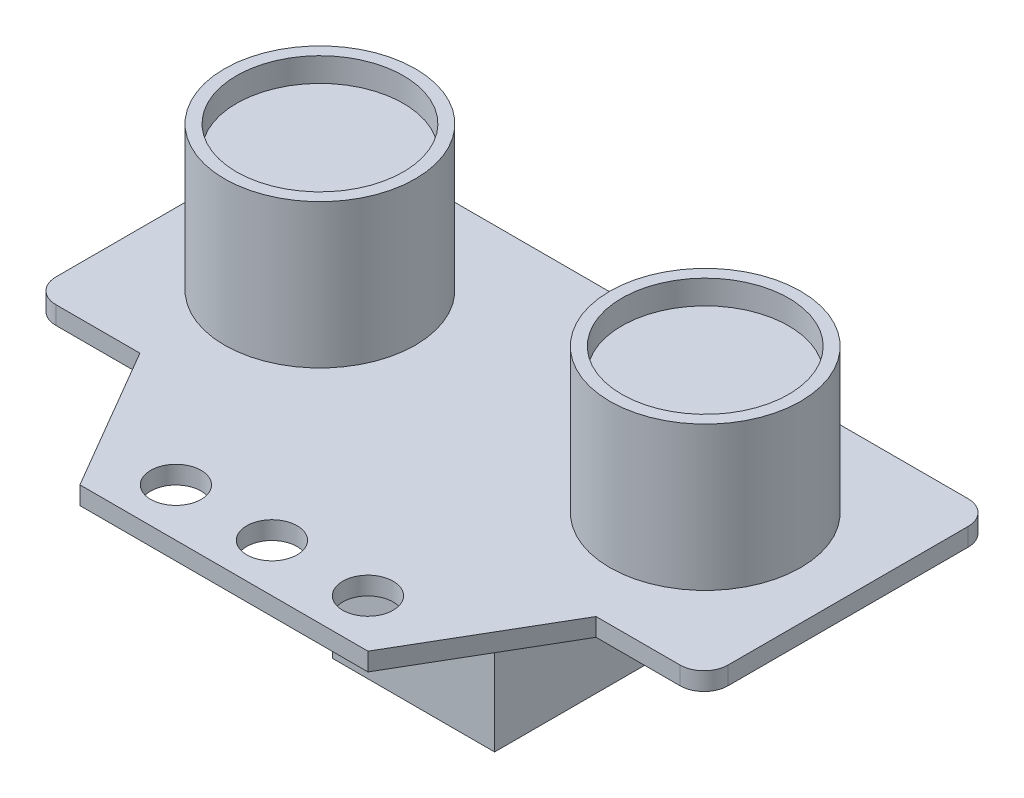
ISO-10303-21;
HEADER;
FILE_DESCRIPTION(('STEP AP214'),'2;1');
FILE_NAME('part.step','',(''),(''),'','','');
FILE_SCHEMA(('AUTOMOTIVE_DESIGN { 1 0 10303 214 1 1 1 1 }'));
ENDSEC;
DATA;
#1=APPLICATION_CONTEXT('core data for automotive mechanical design processes');
#2=APPLICATION_PROTOCOL_DEFINITION('international standard','automotive_design',2000,#1);
#3=PRODUCT_CONTEXT('',#1,'mechanical');
#4=PRODUCT('Part','Part','',(#3));
#5=PRODUCT_RELATED_PRODUCT_CATEGORY('part','',(#4));
#6=PRODUCT_DEFINITION_FORMATION('','',#4);
#7=PRODUCT_DEFINITION_CONTEXT('part definition',#1,'design');
#8=PRODUCT_DEFINITION('design','',#6,#7);
#9=PRODUCT_DEFINITION_SHAPE('','',#8);
#10=(LENGTH_UNIT() NAMED_UNIT(*) SI_UNIT(.MILLI.,.METRE.));
#11=(NAMED_UNIT(*) PLANE_ANGLE_UNIT() SI_UNIT($,.RADIAN.));
#12=(NAMED_UNIT(*) SI_UNIT($,.STERADIAN.) SOLID_ANGLE_UNIT());
#13=UNCERTAINTY_MEASURE_WITH_UNIT(LENGTH_MEASURE(1.E-05),#10,'distance_accuracy_value','');
#14=(GEOMETRIC_REPRESENTATION_CONTEXT(3) GLOBAL_UNCERTAINTY_ASSIGNED_CONTEXT((#13)) GLOBAL_UNIT_ASSIGNED_CONTEXT((#10,
#11,#12)) REPRESENTATION_CONTEXT('',''));
#15=CARTESIAN_POINT('',(0.,0.,0.));
#16=DIRECTION('',(0.,0.,1.));
#17=DIRECTION('',(1.,0.,0.));
#18=AXIS2_PLACEMENT_3D('',#15,#16,#17);
#19=CARTESIAN_POINT('',(0.,0.,0.));
#20=DIRECTION('',(0.,-1.,0.));
#21=DIRECTION('',(0.,0.,-1.));
#22=AXIS2_PLACEMENT_3D('',#19,#20,#21);
#23=PLANE('',#22);
#24=CARTESIAN_POINT('',(-8.,0.,-4.));
#25=DIRECTION('',(0.,1.,0.));
#26=DIRECTION('',(0.,0.,1.));
#27=AXIS2_PLACEMENT_3D('',#24,#25,#26);
#28=CIRCLE('',#27,2.1);
#29=CARTESIAN_POINT('',(-8.,0.,-1.9));
#30=VERTEX_POINT('',#29);
#31=EDGE_CURVE('E185',#30,#30,#28,.T.);
#32=ORIENTED_EDGE('',*,*,#31,.T.);
#33=EDGE_LOOP('',(#32));
#34=FACE_BOUND('',#33,.T.);
#35=DIRECTION('',(0.,0.,-1.));
#36=VECTOR('',#35,1.);
#37=CARTESIAN_POINT('',(28.,0.,-12.));
#38=LINE('',#37,#36);
#39=CARTESIAN_POINT('',(28.,0.,-14.));
#40=VERTEX_POINT('',#39);
#41=CARTESIAN_POINT('',(28.,0.,-34.));
#42=VERTEX_POINT('',#41);
#43=EDGE_CURVE('E231',#40,#42,#38,.T.);
#44=ORIENTED_EDGE('',*,*,#43,.F.);
#45=CARTESIAN_POINT('',(26.,0.,-14.));
#46=DIRECTION('',(0.,-1.,0.));
#47=DIRECTION('',(0.,0.,-1.));
#48=AXIS2_PLACEMENT_3D('',#45,#46,#47);
#49=CIRCLE('',#48,2.);
#50=CARTESIAN_POINT('',(26.,0.,-12.));
#51=VERTEX_POINT('',#50);
#52=EDGE_CURVE('E263',#40,#51,#49,.T.);
#53=ORIENTED_EDGE('',*,*,#52,.T.);
#54=DIRECTION('',(1.,0.,0.));
#55=VECTOR('',#54,1.);
#56=CARTESIAN_POINT('',(19.,0.,-12.));
#57=LINE('',#56,#55);
#58=CARTESIAN_POINT('',(19.,0.,-12.));
#59=VERTEX_POINT('',#58);
#60=EDGE_CURVE('E228',#59,#51,#57,.T.);
#61=ORIENTED_EDGE('',*,*,#60,.F.);
#62=DIRECTION('',(0.503871025524086,0.,-0.863778900898433));
#63=VECTOR('',#62,1.);
#64=CARTESIAN_POINT('',(12.,0.,0.));
#65=LINE('',#64,#63);
#66=CARTESIAN_POINT('',(12.,0.,0.));
#67=VERTEX_POINT('',#66);
#68=EDGE_CURVE('E226',#67,#59,#65,.T.);
#69=ORIENTED_EDGE('',*,*,#68,.F.);
#70=DIRECTION('',(1.,0.,0.));
#71=VECTOR('',#70,1.);
#72=CARTESIAN_POINT('',(12.,0.,0.));
#73=LINE('',#72,#71);
#74=CARTESIAN_POINT('',(-12.,0.,0.));
#75=VERTEX_POINT('',#74);
#76=EDGE_CURVE('E224',#75,#67,#73,.T.);
#77=ORIENTED_EDGE('',*,*,#76,.F.);
#78=DIRECTION('',(0.503871025524086,0.,0.863778900898433));
#79=VECTOR('',#78,1.);
#80=CARTESIAN_POINT('',(-12.,0.,0.));
#81=LINE('',#80,#79);
#82=CARTESIAN_POINT('',(-19.,0.,-12.));
#83=VERTEX_POINT('',#82);
#84=EDGE_CURVE('E197',#83,#75,#81,.T.);
#85=ORIENTED_EDGE('',*,*,#84,.F.);
#86=DIRECTION('',(1.,0.,0.));
#87=VECTOR('',#86,1.);
#88=CARTESIAN_POINT('',(-19.,0.,-12.));
#89=LINE('',#88,#87);
#90=CARTESIAN_POINT('',(-26.,0.,-12.));
#91=VERTEX_POINT('',#90);
#92=EDGE_CURVE('E204',#91,#83,#89,.T.);
#93=ORIENTED_EDGE('',*,*,#92,.F.);
#94=CARTESIAN_POINT('',(-26.,0.,-14.));
#95=DIRECTION('',(0.,-1.,0.));
#96=DIRECTION('',(0.,0.,-1.));
#97=AXIS2_PLACEMENT_3D('',#94,#95,#96);
#98=CIRCLE('',#97,2.);
#99=CARTESIAN_POINT('',(-28.,0.,-14.));
#100=VERTEX_POINT('',#99);
#101=EDGE_CURVE('E257',#91,#100,#98,.T.);
#102=ORIENTED_EDGE('',*,*,#101,.T.);
#103=DIRECTION('',(0.,0.,1.));
#104=VECTOR('',#103,1.);
#105=CARTESIAN_POINT('',(-28.,0.,-12.));
#106=LINE('',#105,#104);
#107=CARTESIAN_POINT('',(-28.,0.,-34.));
#108=VERTEX_POINT('',#107);
#109=EDGE_CURVE('E237',#108,#100,#106,.T.);
#110=ORIENTED_EDGE('',*,*,#109,.F.);
#111=CARTESIAN_POINT('',(-26.,0.,-34.));
#112=DIRECTION('',(0.,-1.,0.));
#113=DIRECTION('',(0.,0.,-1.));
#114=AXIS2_PLACEMENT_3D('',#111,#112,#113);
#115=CIRCLE('',#114,2.);
#116=CARTESIAN_POINT('',(-26.,0.,-36.));
#117=VERTEX_POINT('',#116);
#118=EDGE_CURVE('E259',#108,#117,#115,.T.);
#119=ORIENTED_EDGE('',*,*,#118,.T.);
#120=DIRECTION('',(-1.,0.,0.));
#121=VECTOR('',#120,1.);
#122=CARTESIAN_POINT('',(-28.,0.,-36.));
#123=LINE('',#122,#121);
#124=CARTESIAN_POINT('',(26.,0.,-36.));
#125=VERTEX_POINT('',#124);
#126=EDGE_CURVE('E234',#125,#117,#123,.T.);
#127=ORIENTED_EDGE('',*,*,#126,.F.);
#128=CARTESIAN_POINT('',(26.,0.,-34.));
#129=DIRECTION('',(0.,-1.,0.));
#130=DIRECTION('',(0.,0.,-1.));
#131=AXIS2_PLACEMENT_3D('',#128,#129,#130);
#132=CIRCLE('',#131,2.);
#133=EDGE_CURVE('E261',#125,#42,#132,.T.);
#134=ORIENTED_EDGE('',*,*,#133,.T.);
#135=EDGE_LOOP('',(#44,#53,#61,#69,#77,#85,#93,#102,#110,#119,#127,#134));
#136=FACE_BOUND('',#135,.T.);
#137=CARTESIAN_POINT('',(0.,0.,-4.));
#138=DIRECTION('',(0.,1.,0.));
#139=DIRECTION('',(0.,0.,1.));
#140=AXIS2_PLACEMENT_3D('',#137,#138,#139);
#141=CIRCLE('',#140,2.1);
#142=CARTESIAN_POINT('',(0.,0.,-1.9));
#143=VERTEX_POINT('',#142);
#144=EDGE_CURVE('E191',#143,#143,#141,.T.);
#145=ORIENTED_EDGE('',*,*,#144,.T.);
#146=EDGE_LOOP('',(#145));
#147=FACE_BOUND('',#146,.T.);
#148=CARTESIAN_POINT('',(8.,0.,-4.));
#149=DIRECTION('',(0.,1.,0.));
#150=DIRECTION('',(0.,0.,1.));
#151=AXIS2_PLACEMENT_3D('',#148,#149,#150);
#152=CIRCLE('',#151,2.1);
#153=CARTESIAN_POINT('',(8.,0.,-1.9));
#154=VERTEX_POINT('',#153);
#155=EDGE_CURVE('E181',#154,#154,#152,.T.);
#156=ORIENTED_EDGE('',*,*,#155,.T.);
#157=EDGE_LOOP('',(#156));
#158=FACE_BOUND('',#157,.T.);
#159=DIRECTION('',(1.,0.,0.));
#160=VECTOR('',#159,1.);
#161=CARTESIAN_POINT('',(-6.75,0.,-31.8));
#162=LINE('',#161,#160);
#163=CARTESIAN_POINT('',(-6.75,0.,-31.8));
#164=VERTEX_POINT('',#163);
#165=CARTESIAN_POINT('',(6.75,0.,-31.8));
#166=VERTEX_POINT('',#165);
#167=EDGE_CURVE('E318',#164,#166,#162,.T.);
#168=ORIENTED_EDGE('',*,*,#167,.F.);
#169=DIRECTION('',(0.,0.,-1.));
#170=VECTOR('',#169,1.);
#171=CARTESIAN_POINT('',(-6.75,0.,-15.8));
#172=LINE('',#171,#170);
#173=CARTESIAN_POINT('',(-6.75,0.,-15.8));
#174=VERTEX_POINT('',#173);
#175=EDGE_CURVE('E169',#174,#164,#172,.T.);
#176=ORIENTED_EDGE('',*,*,#175,.F.);
#177=DIRECTION('',(-1.,0.,0.));
#178=VECTOR('',#177,1.);
#179=CARTESIAN_POINT('',(-6.75,0.,-15.8));
#180=LINE('',#179,#178);
#181=CARTESIAN_POINT('',(6.75,0.,-15.8));
#182=VERTEX_POINT('',#181);
#183=EDGE_CURVE('E165',#182,#174,#180,.T.);
#184=ORIENTED_EDGE('',*,*,#183,.F.);
#185=DIRECTION('',(0.,0.,1.));
#186=VECTOR('',#185,1.);
#187=CARTESIAN_POINT('',(6.75,0.,-15.8));
#188=LINE('',#187,#186);
#189=EDGE_CURVE('E320',#166,#182,#188,.T.);
#190=ORIENTED_EDGE('',*,*,#189,.F.);
#191=EDGE_LOOP('',(#168,#176,#184,#190));
#192=FACE_BOUND('',#191,.T.);
#193=ADVANCED_FACE('F32',(#34,#136,#147,#158,#192),#23,.T.);
#194=CARTESIAN_POINT('',(0.,1.5,0.));
#195=DIRECTION('',(0.,-1.,0.));
#196=DIRECTION('',(0.,0.,-1.));
#197=AXIS2_PLACEMENT_3D('',#194,#195,#196);
#198=PLANE('',#197);
#199=CARTESIAN_POINT('',(16.05,1.5,-24.05));
#200=DIRECTION('',(0.,-1.,0.));
#201=DIRECTION('',(0.,0.,-1.));
#202=AXIS2_PLACEMENT_3D('',#199,#200,#201);
#203=CIRCLE('',#202,7.95);
#204=CARTESIAN_POINT('',(16.05,1.5,-32.));
#205=VERTEX_POINT('',#204);
#206=EDGE_CURVE('E11',#205,#205,#203,.F.);
#207=ORIENTED_EDGE('',*,*,#206,.F.);
#208=EDGE_LOOP('',(#207));
#209=FACE_BOUND('',#208,.T.);
#210=CARTESIAN_POINT('',(-16.05,1.5,-24.05));
#211=DIRECTION('',(0.,-1.,0.));
#212=DIRECTION('',(0.,0.,-1.));
#213=AXIS2_PLACEMENT_3D('',#210,#211,#212);
#214=CIRCLE('',#213,7.95);
#215=CARTESIAN_POINT('',(-16.05,1.5,-32.));
#216=VERTEX_POINT('',#215);
#217=EDGE_CURVE('E40',#216,#216,#214,.F.);
#218=ORIENTED_EDGE('',*,*,#217,.F.);
#219=EDGE_LOOP('',(#218));
#220=FACE_BOUND('',#219,.T.);
#221=DIRECTION('',(1.,0.,0.));
#222=VECTOR('',#221,1.);
#223=CARTESIAN_POINT('',(19.,1.5,-12.));
#224=LINE('',#223,#222);
#225=CARTESIAN_POINT('',(19.,1.5,-12.));
#226=VERTEX_POINT('',#225);
#227=CARTESIAN_POINT('',(26.,1.5,-12.));
#228=VERTEX_POINT('',#227);
#229=EDGE_CURVE('E208',#226,#228,#224,.T.);
#230=ORIENTED_EDGE('',*,*,#229,.T.);
#231=CARTESIAN_POINT('',(26.,1.5,-14.));
#232=DIRECTION('',(0.,-1.,0.));
#233=DIRECTION('',(0.,0.,-1.));
#234=AXIS2_PLACEMENT_3D('',#231,#232,#233);
#235=CIRCLE('',#234,2.);
#236=CARTESIAN_POINT('',(28.,1.5,-14.));
#237=VERTEX_POINT('',#236);
#238=EDGE_CURVE('E272',#228,#237,#235,.F.);
#239=ORIENTED_EDGE('',*,*,#238,.T.);
#240=DIRECTION('',(0.,0.,-1.));
#241=VECTOR('',#240,1.);
#242=CARTESIAN_POINT('',(28.,1.5,-12.));
#243=LINE('',#242,#241);
#244=CARTESIAN_POINT('',(28.,1.5,-34.));
#245=VERTEX_POINT('',#244);
#246=EDGE_CURVE('E211',#237,#245,#243,.T.);
#247=ORIENTED_EDGE('',*,*,#246,.T.);
#248=CARTESIAN_POINT('',(26.,1.5,-34.));
#249=DIRECTION('',(0.,-1.,0.));
#250=DIRECTION('',(0.,0.,-1.));
#251=AXIS2_PLACEMENT_3D('',#248,#249,#250);
#252=CIRCLE('',#251,2.);
#253=CARTESIAN_POINT('',(26.,1.5,-36.));
#254=VERTEX_POINT('',#253);
#255=EDGE_CURVE('E270',#245,#254,#252,.F.);
#256=ORIENTED_EDGE('',*,*,#255,.T.);
#257=DIRECTION('',(-1.,0.,0.));
#258=VECTOR('',#257,1.);
#259=CARTESIAN_POINT('',(-28.,1.5,-36.));
#260=LINE('',#259,#258);
#261=CARTESIAN_POINT('',(-26.,1.5,-36.));
#262=VERTEX_POINT('',#261);
#263=EDGE_CURVE('E214',#254,#262,#260,.T.);
#264=ORIENTED_EDGE('',*,*,#263,.T.);
#265=CARTESIAN_POINT('',(-26.,1.5,-34.));
#266=DIRECTION('',(0.,-1.,0.));
#267=DIRECTION('',(0.,0.,-1.));
#268=AXIS2_PLACEMENT_3D('',#265,#266,#267);
#269=CIRCLE('',#268,2.);
#270=CARTESIAN_POINT('',(-28.,1.5,-34.));
#271=VERTEX_POINT('',#270);
#272=EDGE_CURVE('E268',#262,#271,#269,.F.);
#273=ORIENTED_EDGE('',*,*,#272,.T.);
#274=DIRECTION('',(0.,0.,1.));
#275=VECTOR('',#274,1.);
#276=CARTESIAN_POINT('',(-28.,1.5,-12.));
#277=LINE('',#276,#275);
#278=CARTESIAN_POINT('',(-28.,1.5,-14.));
#279=VERTEX_POINT('',#278);
#280=EDGE_CURVE('E217',#271,#279,#277,.T.);
#281=ORIENTED_EDGE('',*,*,#280,.T.);
#282=CARTESIAN_POINT('',(-26.,1.5,-14.));
#283=DIRECTION('',(0.,-1.,0.));
#284=DIRECTION('',(0.,0.,-1.));
#285=AXIS2_PLACEMENT_3D('',#282,#283,#284);
#286=CIRCLE('',#285,2.);
#287=CARTESIAN_POINT('',(-26.,1.5,-12.));
#288=VERTEX_POINT('',#287);
#289=EDGE_CURVE('E55',#279,#288,#286,.F.);
#290=ORIENTED_EDGE('',*,*,#289,.T.);
#291=DIRECTION('',(1.,0.,0.));
#292=VECTOR('',#291,1.);
#293=CARTESIAN_POINT('',(-19.,1.5,-12.));
#294=LINE('',#293,#292);
#295=CARTESIAN_POINT('',(-19.,1.5,-12.));
#296=VERTEX_POINT('',#295);
#297=EDGE_CURVE('E219',#288,#296,#294,.T.);
#298=ORIENTED_EDGE('',*,*,#297,.T.);
#299=DIRECTION('',(0.503871025524086,0.,0.863778900898433));
#300=VECTOR('',#299,1.);
#301=CARTESIAN_POINT('',(-12.,1.5,0.));
#302=LINE('',#301,#300);
#303=CARTESIAN_POINT('',(-12.,1.5,0.));
#304=VERTEX_POINT('',#303);
#305=EDGE_CURVE('E200',#296,#304,#302,.T.);
#306=ORIENTED_EDGE('',*,*,#305,.T.);
#307=DIRECTION('',(1.,0.,0.));
#308=VECTOR('',#307,1.);
#309=CARTESIAN_POINT('',(12.,1.5,0.));
#310=LINE('',#309,#308);
#311=CARTESIAN_POINT('',(12.,1.5,0.));
#312=VERTEX_POINT('',#311);
#313=EDGE_CURVE('E203',#304,#312,#310,.T.);
#314=ORIENTED_EDGE('',*,*,#313,.T.);
#315=DIRECTION('',(0.503871025524086,0.,-0.863778900898433));
#316=VECTOR('',#315,1.);
#317=CARTESIAN_POINT('',(12.,1.5,0.));
#318=LINE('',#317,#316);
#319=EDGE_CURVE('E206',#312,#226,#318,.T.);
#320=ORIENTED_EDGE('',*,*,#319,.T.);
#321=EDGE_LOOP('',(#230,#239,#247,#256,#264,#273,#281,#290,#298,#306,#314,#320));
#322=FACE_BOUND('',#321,.T.);
#323=CARTESIAN_POINT('',(0.,1.5,-4.));
#324=DIRECTION('',(0.,1.,0.));
#325=DIRECTION('',(0.,0.,1.));
#326=AXIS2_PLACEMENT_3D('',#323,#324,#325);
#327=CIRCLE('',#326,2.1);
#328=CARTESIAN_POINT('',(0.,1.5,-1.9));
#329=VERTEX_POINT('',#328);
#330=EDGE_CURVE('E194',#329,#329,#327,.T.);
#331=ORIENTED_EDGE('',*,*,#330,.F.);
#332=EDGE_LOOP('',(#331));
#333=FACE_BOUND('',#332,.T.);
#334=CARTESIAN_POINT('',(-8.,1.5,-4.));
#335=DIRECTION('',(0.,1.,0.));
#336=DIRECTION('',(0.,0.,1.));
#337=AXIS2_PLACEMENT_3D('',#334,#335,#336);
#338=CIRCLE('',#337,2.1);
#339=CARTESIAN_POINT('',(-8.,1.5,-1.9));
#340=VERTEX_POINT('',#339);
#341=EDGE_CURVE('E188',#340,#340,#338,.T.);
#342=ORIENTED_EDGE('',*,*,#341,.F.);
#343=EDGE_LOOP('',(#342));
#344=FACE_BOUND('',#343,.T.);
#345=CARTESIAN_POINT('',(8.,1.5,-4.));
#346=DIRECTION('',(0.,1.,0.));
#347=DIRECTION('',(0.,0.,1.));
#348=AXIS2_PLACEMENT_3D('',#345,#346,#347);
#349=CIRCLE('',#348,2.1);
#350=CARTESIAN_POINT('',(8.,1.5,-1.9));
#351=VERTEX_POINT('',#350);
#352=EDGE_CURVE('E182',#351,#351,#349,.T.);
#353=ORIENTED_EDGE('',*,*,#352,.F.);
#354=EDGE_LOOP('',(#353));
#355=FACE_BOUND('',#354,.T.);
#356=ADVANCED_FACE('F291',(#209,#220,#322,#333,#344,#355),#198,.F.);
#357=CARTESIAN_POINT('',(-12.,1.5,0.));
#358=DIRECTION('',(0.863778900898433,0.,-0.503871025524086));
#359=DIRECTION('',(-0.503871025524086,0.,-0.863778900898433));
#360=AXIS2_PLACEMENT_3D('',#357,#358,#359);
#361=PLANE('',#360);
#362=ORIENTED_EDGE('',*,*,#84,.T.);
#363=DIRECTION('',(0.,-1.,0.));
#364=VECTOR('',#363,1.);
#365=CARTESIAN_POINT('',(-12.,1.5,0.));
#366=LINE('',#365,#364);
#367=EDGE_CURVE('E249',#304,#75,#366,.T.);
#368=ORIENTED_EDGE('',*,*,#367,.F.);
#369=ORIENTED_EDGE('',*,*,#305,.F.);
#370=DIRECTION('',(0.,-1.,0.));
#371=VECTOR('',#370,1.);
#372=CARTESIAN_POINT('',(-19.,1.5,-12.));
#373=LINE('',#372,#371);
#374=EDGE_CURVE('E221',#296,#83,#373,.T.);
#375=ORIENTED_EDGE('',*,*,#374,.T.);
#376=EDGE_LOOP('',(#362,#368,#369,#375));
#377=FACE_BOUND('',#376,.T.);
#378=ADVANCED_FACE('F293',(#377),#361,.F.);
#379=CARTESIAN_POINT('',(12.,1.5,0.));
#380=DIRECTION('',(0.,0.,-1.));
#381=DIRECTION('',(-1.,0.,0.));
#382=AXIS2_PLACEMENT_3D('',#379,#380,#381);
#383=PLANE('',#382);
#384=ORIENTED_EDGE('',*,*,#76,.T.);
#385=DIRECTION('',(0.,-1.,0.));
#386=VECTOR('',#385,1.);
#387=CARTESIAN_POINT('',(12.,1.5,0.));
#388=LINE('',#387,#386);
#389=EDGE_CURVE('E246',#312,#67,#388,.T.);
#390=ORIENTED_EDGE('',*,*,#389,.F.);
#391=ORIENTED_EDGE('',*,*,#313,.F.);
#392=ORIENTED_EDGE('',*,*,#367,.T.);
#393=EDGE_LOOP('',(#384,#390,#391,#392));
#394=FACE_BOUND('',#393,.T.);
#395=ADVANCED_FACE('F398',(#394),#383,.F.);
#396=CARTESIAN_POINT('',(12.,1.5,0.));
#397=DIRECTION('',(-0.863778900898433,0.,-0.503871025524086));
#398=DIRECTION('',(-0.503871025524086,0.,0.863778900898433));
#399=AXIS2_PLACEMENT_3D('',#396,#397,#398);
#400=PLANE('',#399);
#401=ORIENTED_EDGE('',*,*,#68,.T.);
#402=DIRECTION('',(0.,-1.,0.));
#403=VECTOR('',#402,1.);
#404=CARTESIAN_POINT('',(19.,1.5,-12.));
#405=LINE('',#404,#403);
#406=EDGE_CURVE('E243',#226,#59,#405,.T.);
#407=ORIENTED_EDGE('',*,*,#406,.F.);
#408=ORIENTED_EDGE('',*,*,#319,.F.);
#409=ORIENTED_EDGE('',*,*,#389,.T.);
#410=EDGE_LOOP('',(#401,#407,#408,#409));
#411=FACE_BOUND('',#410,.T.);
#412=ADVANCED_FACE('F394',(#411),#400,.F.);
#413=CARTESIAN_POINT('',(19.,1.5,-12.));
#414=DIRECTION('',(0.,0.,-1.));
#415=DIRECTION('',(-1.,0.,0.));
#416=AXIS2_PLACEMENT_3D('',#413,#414,#415);
#417=PLANE('',#416);
#418=ORIENTED_EDGE('',*,*,#60,.T.);
#419=DIRECTION('',(0.,-1.,0.));
#420=VECTOR('',#419,1.);
#421=CARTESIAN_POINT('',(26.,1.5,-12.));
#422=LINE('',#421,#420);
#423=EDGE_CURVE('E265',#51,#228,#422,.F.);
#424=ORIENTED_EDGE('',*,*,#423,.T.);
#425=ORIENTED_EDGE('',*,*,#229,.F.);
#426=ORIENTED_EDGE('',*,*,#406,.T.);
#427=EDGE_LOOP('',(#418,#424,#425,#426));
#428=FACE_BOUND('',#427,.T.);
#429=ADVANCED_FACE('F390',(#428),#417,.F.);
#430=CARTESIAN_POINT('',(28.,1.5,-12.));
#431=DIRECTION('',(-1.,0.,0.));
#432=DIRECTION('',(0.,0.,1.));
#433=AXIS2_PLACEMENT_3D('',#430,#431,#432);
#434=PLANE('',#433);
#435=ORIENTED_EDGE('',*,*,#246,.F.);
#436=DIRECTION('',(0.,-1.,0.));
#437=VECTOR('',#436,1.);
#438=CARTESIAN_POINT('',(28.,1.5,-14.));
#439=LINE('',#438,#437);
#440=EDGE_CURVE('E254',#237,#40,#439,.T.);
#441=ORIENTED_EDGE('',*,*,#440,.T.);
#442=ORIENTED_EDGE('',*,*,#43,.T.);
#443=DIRECTION('',(0.,-1.,0.));
#444=VECTOR('',#443,1.);
#445=CARTESIAN_POINT('',(28.,1.5,-34.));
#446=LINE('',#445,#444);
#447=EDGE_CURVE('E252',#42,#245,#446,.F.);
#448=ORIENTED_EDGE('',*,*,#447,.T.);
#449=EDGE_LOOP('',(#435,#441,#442,#448));
#450=FACE_BOUND('',#449,.T.);
#451=ADVANCED_FACE('F386',(#450),#434,.F.);
#452=CARTESIAN_POINT('',(-28.,1.5,-36.));
#453=DIRECTION('',(0.,0.,1.));
#454=DIRECTION('',(1.,0.,0.));
#455=AXIS2_PLACEMENT_3D('',#452,#453,#454);
#456=PLANE('',#455);
#457=ORIENTED_EDGE('',*,*,#263,.F.);
#458=DIRECTION('',(0.,-1.,0.));
#459=VECTOR('',#458,1.);
#460=CARTESIAN_POINT('',(26.,1.5,-36.));
#461=LINE('',#460,#459);
#462=EDGE_CURVE('E276',#254,#125,#461,.T.);
#463=ORIENTED_EDGE('',*,*,#462,.T.);
#464=ORIENTED_EDGE('',*,*,#126,.T.);
#465=DIRECTION('',(0.,-1.,0.));
#466=VECTOR('',#465,1.);
#467=CARTESIAN_POINT('',(-26.,1.5,-36.));
#468=LINE('',#467,#466);
#469=EDGE_CURVE('E274',#117,#262,#468,.F.);
#470=ORIENTED_EDGE('',*,*,#469,.T.);
#471=EDGE_LOOP('',(#457,#463,#464,#470));
#472=FACE_BOUND('',#471,.T.);
#473=ADVANCED_FACE('F382',(#472),#456,.F.);
#474=CARTESIAN_POINT('',(-28.,1.5,-12.));
#475=DIRECTION('',(1.,0.,0.));
#476=DIRECTION('',(0.,0.,-1.));
#477=AXIS2_PLACEMENT_3D('',#474,#475,#476);
#478=PLANE('',#477);
#479=ORIENTED_EDGE('',*,*,#280,.F.);
#480=DIRECTION('',(0.,-1.,0.));
#481=VECTOR('',#480,1.);
#482=CARTESIAN_POINT('',(-28.,1.5,-34.));
#483=LINE('',#482,#481);
#484=EDGE_CURVE('E281',#271,#108,#483,.T.);
#485=ORIENTED_EDGE('',*,*,#484,.T.);
#486=ORIENTED_EDGE('',*,*,#109,.T.);
#487=DIRECTION('',(0.,-1.,0.));
#488=VECTOR('',#487,1.);
#489=CARTESIAN_POINT('',(-28.,1.5,-14.));
#490=LINE('',#489,#488);
#491=EDGE_CURVE('E279',#100,#279,#490,.F.);
#492=ORIENTED_EDGE('',*,*,#491,.T.);
#493=EDGE_LOOP('',(#479,#485,#486,#492));
#494=FACE_BOUND('',#493,.T.);
#495=ADVANCED_FACE('F378',(#494),#478,.F.);
#496=CARTESIAN_POINT('',(-19.,1.5,-12.));
#497=DIRECTION('',(0.,0.,-1.));
#498=DIRECTION('',(-1.,0.,0.));
#499=AXIS2_PLACEMENT_3D('',#496,#497,#498);
#500=PLANE('',#499);
#501=ORIENTED_EDGE('',*,*,#297,.F.);
#502=DIRECTION('',(0.,-1.,0.));
#503=VECTOR('',#502,1.);
#504=CARTESIAN_POINT('',(-26.,1.5,-12.));
#505=LINE('',#504,#503);
#506=EDGE_CURVE('E284',#288,#91,#505,.T.);
#507=ORIENTED_EDGE('',*,*,#506,.T.);
#508=ORIENTED_EDGE('',*,*,#92,.T.);
#509=ORIENTED_EDGE('',*,*,#374,.F.);
#510=EDGE_LOOP('',(#501,#507,#508,#509));
#511=FACE_BOUND('',#510,.T.);
#512=ADVANCED_FACE('F373',(#511),#500,.F.);
#513=CARTESIAN_POINT('',(0.,1.5,-4.));
#514=DIRECTION('',(0.,-1.,0.));
#515=DIRECTION('',(0.,0.,-1.));
#516=AXIS2_PLACEMENT_3D('',#513,#514,#515);
#517=CYLINDRICAL_SURFACE('',#516,2.1);
#518=ORIENTED_EDGE('',*,*,#330,.T.);
#519=EDGE_LOOP('',(#518));
#520=FACE_BOUND('',#519,.T.);
#521=ORIENTED_EDGE('',*,*,#144,.F.);
#522=EDGE_LOOP('',(#521));
#523=FACE_BOUND('',#522,.T.);
#524=ADVANCED_FACE('F370',(#520,#523),#517,.F.);
#525=CARTESIAN_POINT('',(-8.,1.5,-4.));
#526=DIRECTION('',(0.,-1.,0.));
#527=DIRECTION('',(0.,0.,-1.));
#528=AXIS2_PLACEMENT_3D('',#525,#526,#527);
#529=CYLINDRICAL_SURFACE('',#528,2.1);
#530=ORIENTED_EDGE('',*,*,#341,.T.);
#531=EDGE_LOOP('',(#530));
#532=FACE_BOUND('',#531,.T.);
#533=ORIENTED_EDGE('',*,*,#31,.F.);
#534=EDGE_LOOP('',(#533));
#535=FACE_BOUND('',#534,.T.);
#536=ADVANCED_FACE('F309',(#532,#535),#529,.F.);
#537=CARTESIAN_POINT('',(8.,1.5,-4.));
#538=DIRECTION('',(0.,-1.,0.));
#539=DIRECTION('',(0.,0.,-1.));
#540=AXIS2_PLACEMENT_3D('',#537,#538,#539);
#541=CYLINDRICAL_SURFACE('',#540,2.1);
#542=ORIENTED_EDGE('',*,*,#352,.T.);
#543=EDGE_LOOP('',(#542));
#544=FACE_BOUND('',#543,.T.);
#545=ORIENTED_EDGE('',*,*,#155,.F.);
#546=EDGE_LOOP('',(#545));
#547=FACE_BOUND('',#546,.T.);
#548=ADVANCED_FACE('F305',(#544,#547),#541,.F.);
#549=CARTESIAN_POINT('',(26.,1.5,-14.));
#550=DIRECTION('',(0.,-1.,0.));
#551=DIRECTION('',(0.,0.,-1.));
#552=AXIS2_PLACEMENT_3D('',#549,#550,#551);
#553=CYLINDRICAL_SURFACE('',#552,2.);
#554=ORIENTED_EDGE('',*,*,#238,.F.);
#555=ORIENTED_EDGE('',*,*,#423,.F.);
#556=ORIENTED_EDGE('',*,*,#52,.F.);
#557=ORIENTED_EDGE('',*,*,#440,.F.);
#558=EDGE_LOOP('',(#554,#555,#556,#557));
#559=FACE_BOUND('',#558,.T.);
#560=ADVANCED_FACE('F308',(#559),#553,.T.);
#561=CARTESIAN_POINT('',(26.,1.5,-34.));
#562=DIRECTION('',(0.,-1.,0.));
#563=DIRECTION('',(0.,0.,-1.));
#564=AXIS2_PLACEMENT_3D('',#561,#562,#563);
#565=CYLINDRICAL_SURFACE('',#564,2.);
#566=ORIENTED_EDGE('',*,*,#255,.F.);
#567=ORIENTED_EDGE('',*,*,#447,.F.);
#568=ORIENTED_EDGE('',*,*,#133,.F.);
#569=ORIENTED_EDGE('',*,*,#462,.F.);
#570=EDGE_LOOP('',(#566,#567,#568,#569));
#571=FACE_BOUND('',#570,.T.);
#572=ADVANCED_FACE('F408',(#571),#565,.T.);
#573=CARTESIAN_POINT('',(-26.,1.5,-34.));
#574=DIRECTION('',(0.,-1.,0.));
#575=DIRECTION('',(0.,0.,-1.));
#576=AXIS2_PLACEMENT_3D('',#573,#574,#575);
#577=CYLINDRICAL_SURFACE('',#576,2.);
#578=ORIENTED_EDGE('',*,*,#272,.F.);
#579=ORIENTED_EDGE('',*,*,#469,.F.);
#580=ORIENTED_EDGE('',*,*,#118,.F.);
#581=ORIENTED_EDGE('',*,*,#484,.F.);
#582=EDGE_LOOP('',(#578,#579,#580,#581));
#583=FACE_BOUND('',#582,.T.);
#584=ADVANCED_FACE('F364',(#583),#577,.T.);
#585=CARTESIAN_POINT('',(-26.,1.5,-14.));
#586=DIRECTION('',(0.,-1.,0.));
#587=DIRECTION('',(0.,0.,-1.));
#588=AXIS2_PLACEMENT_3D('',#585,#586,#587);
#589=CYLINDRICAL_SURFACE('',#588,2.);
#590=ORIENTED_EDGE('',*,*,#289,.F.);
#591=ORIENTED_EDGE('',*,*,#491,.F.);
#592=ORIENTED_EDGE('',*,*,#101,.F.);
#593=ORIENTED_EDGE('',*,*,#506,.F.);
#594=EDGE_LOOP('',(#590,#591,#592,#593));
#595=FACE_BOUND('',#594,.T.);
#596=ADVANCED_FACE('F34',(#595),#589,.T.);
#597=CARTESIAN_POINT('',(-16.05,13.5,-24.05));
#598=DIRECTION('',(0.,-1.,0.));
#599=DIRECTION('',(0.,0.,-1.));
#600=AXIS2_PLACEMENT_3D('',#597,#598,#599);
#601=CYLINDRICAL_SURFACE('',#600,7.95);
#602=CARTESIAN_POINT('',(-16.05,13.5,-24.05));
#603=DIRECTION('',(0.,1.,0.));
#604=DIRECTION('',(0.,0.,1.));
#605=AXIS2_PLACEMENT_3D('',#602,#603,#604);
#606=CIRCLE('',#605,7.95);
#607=CARTESIAN_POINT('',(-16.05,13.5,-16.1));
#608=VERTEX_POINT('',#607);
#609=EDGE_CURVE('E174',#608,#608,#606,.T.);
#610=ORIENTED_EDGE('',*,*,#609,.F.);
#611=EDGE_LOOP('',(#610));
#612=FACE_BOUND('',#611,.T.);
#613=ORIENTED_EDGE('',*,*,#217,.T.);
#614=EDGE_LOOP('',(#613));
#615=FACE_BOUND('',#614,.T.);
#616=ADVANCED_FACE('F289',(#612,#615),#601,.T.);
#617=CARTESIAN_POINT('',(-16.05,13.5,-24.05));
#618=DIRECTION('',(0.,1.,0.));
#619=DIRECTION('',(0.,0.,1.));
#620=AXIS2_PLACEMENT_3D('',#617,#618,#619);
#621=PLANE('',#620);
#622=CARTESIAN_POINT('',(-16.05,13.5,-24.05));
#623=DIRECTION('',(0.,1.,0.));
#624=DIRECTION('',(0.,0.,1.));
#625=AXIS2_PLACEMENT_3D('',#622,#623,#624);
#626=CIRCLE('',#625,6.95);
#627=CARTESIAN_POINT('',(-16.05,13.5,-17.1));
#628=VERTEX_POINT('',#627);
#629=EDGE_CURVE('E337',#628,#628,#626,.T.);
#630=ORIENTED_EDGE('',*,*,#629,.F.);
#631=EDGE_LOOP('',(#630));
#632=FACE_BOUND('',#631,.T.);
#633=ORIENTED_EDGE('',*,*,#609,.T.);
#634=EDGE_LOOP('',(#633));
#635=FACE_BOUND('',#634,.T.);
#636=ADVANCED_FACE('F352',(#632,#635),#621,.T.);
#637=CARTESIAN_POINT('',(16.05,13.5,-24.05));
#638=DIRECTION('',(0.,-1.,0.));
#639=DIRECTION('',(0.,0.,-1.));
#640=AXIS2_PLACEMENT_3D('',#637,#638,#639);
#641=CYLINDRICAL_SURFACE('',#640,7.95);
#642=CARTESIAN_POINT('',(16.05,13.5,-24.05));
#643=DIRECTION('',(0.,1.,0.));
#644=DIRECTION('',(0.,0.,-1.));
#645=AXIS2_PLACEMENT_3D('',#642,#643,#644);
#646=CIRCLE('',#645,7.95);
#647=CARTESIAN_POINT('',(16.05,13.5,-32.));
#648=VERTEX_POINT('',#647);
#649=EDGE_CURVE('E171',#648,#648,#646,.T.);
#650=ORIENTED_EDGE('',*,*,#649,.F.);
#651=EDGE_LOOP('',(#650));
#652=FACE_BOUND('',#651,.T.);
#653=ORIENTED_EDGE('',*,*,#206,.T.);
#654=EDGE_LOOP('',(#653));
#655=FACE_BOUND('',#654,.T.);
#656=ADVANCED_FACE('F355',(#652,#655),#641,.T.);
#657=CARTESIAN_POINT('',(16.05,13.5,-24.05));
#658=DIRECTION('',(0.,-1.,0.));
#659=DIRECTION('',(0.,0.,-1.));
#660=AXIS2_PLACEMENT_3D('',#657,#658,#659);
#661=PLANE('',#660);
#662=CARTESIAN_POINT('',(16.05,13.5,-24.05));
#663=DIRECTION('',(0.,1.,0.));
#664=DIRECTION('',(0.,0.,1.));
#665=AXIS2_PLACEMENT_3D('',#662,#663,#664);
#666=CIRCLE('',#665,6.95);
#667=CARTESIAN_POINT('',(16.05,13.5,-17.1));
#668=VERTEX_POINT('',#667);
#669=EDGE_CURVE('E331',#668,#668,#666,.T.);
#670=ORIENTED_EDGE('',*,*,#669,.F.);
#671=EDGE_LOOP('',(#670));
#672=FACE_BOUND('',#671,.T.);
#673=ORIENTED_EDGE('',*,*,#649,.T.);
#674=EDGE_LOOP('',(#673));
#675=FACE_BOUND('',#674,.T.);
#676=ADVANCED_FACE('F473',(#672,#675),#661,.F.);
#677=CARTESIAN_POINT('',(-6.75,-16.3,-15.8));
#678=DIRECTION('',(1.,0.,0.));
#679=DIRECTION('',(0.,0.,-1.));
#680=AXIS2_PLACEMENT_3D('',#677,#678,#679);
#681=PLANE('',#680);
#682=ORIENTED_EDGE('',*,*,#175,.T.);
#683=DIRECTION('',(0.,1.,0.));
#684=VECTOR('',#683,1.);
#685=CARTESIAN_POINT('',(-6.75,-16.3,-31.8));
#686=LINE('',#685,#684);
#687=CARTESIAN_POINT('',(-6.75,-16.3,-31.8));
#688=VERTEX_POINT('',#687);
#689=EDGE_CURVE('E150',#688,#164,#686,.T.);
#690=ORIENTED_EDGE('',*,*,#689,.F.);
#691=DIRECTION('',(0.,0.,-1.));
#692=VECTOR('',#691,1.);
#693=CARTESIAN_POINT('',(-6.75,-16.3,-15.8));
#694=LINE('',#693,#692);
#695=CARTESIAN_POINT('',(-6.75,-16.3,-15.8));
#696=VERTEX_POINT('',#695);
#697=EDGE_CURVE('E157',#696,#688,#694,.T.);
#698=ORIENTED_EDGE('',*,*,#697,.F.);
#699=DIRECTION('',(0.,1.,0.));
#700=VECTOR('',#699,1.);
#701=CARTESIAN_POINT('',(-6.75,-16.3,-15.8));
#702=LINE('',#701,#700);
#703=EDGE_CURVE('E328',#696,#174,#702,.T.);
#704=ORIENTED_EDGE('',*,*,#703,.T.);
#705=EDGE_LOOP('',(#682,#690,#698,#704));
#706=FACE_BOUND('',#705,.T.);
#707=ADVANCED_FACE('F167',(#706),#681,.F.);
#708=CARTESIAN_POINT('',(-6.75,-16.3,-31.8));
#709=DIRECTION('',(0.,0.,1.));
#710=DIRECTION('',(1.,0.,0.));
#711=AXIS2_PLACEMENT_3D('',#708,#709,#710);
#712=PLANE('',#711);
#713=ORIENTED_EDGE('',*,*,#167,.T.);
#714=DIRECTION('',(0.,1.,0.));
#715=VECTOR('',#714,1.);
#716=CARTESIAN_POINT('',(6.75,-16.3,-31.8));
#717=LINE('',#716,#715);
#718=CARTESIAN_POINT('',(6.75,-16.3,-31.8));
#719=VERTEX_POINT('',#718);
#720=EDGE_CURVE('E153',#719,#166,#717,.T.);
#721=ORIENTED_EDGE('',*,*,#720,.F.);
#722=DIRECTION('',(1.,0.,0.));
#723=VECTOR('',#722,1.);
#724=CARTESIAN_POINT('',(-6.75,-16.3,-31.8));
#725=LINE('',#724,#723);
#726=EDGE_CURVE('E146',#688,#719,#725,.T.);
#727=ORIENTED_EDGE('',*,*,#726,.F.);
#728=ORIENTED_EDGE('',*,*,#689,.T.);
#729=EDGE_LOOP('',(#713,#721,#727,#728));
#730=FACE_BOUND('',#729,.T.);
#731=ADVANCED_FACE('F148',(#730),#712,.F.);
#732=CARTESIAN_POINT('',(6.75,-16.3,-15.8));
#733=DIRECTION('',(-1.,0.,0.));
#734=DIRECTION('',(0.,0.,1.));
#735=AXIS2_PLACEMENT_3D('',#732,#733,#734);
#736=PLANE('',#735);
#737=ORIENTED_EDGE('',*,*,#189,.T.);
#738=DIRECTION('',(0.,1.,0.));
#739=VECTOR('',#738,1.);
#740=CARTESIAN_POINT('',(6.75,-16.3,-15.8));
#741=LINE('',#740,#739);
#742=CARTESIAN_POINT('',(6.75,-16.3,-15.8));
#743=VERTEX_POINT('',#742);
#744=EDGE_CURVE('E47',#743,#182,#741,.T.);
#745=ORIENTED_EDGE('',*,*,#744,.F.);
#746=DIRECTION('',(0.,0.,1.));
#747=VECTOR('',#746,1.);
#748=CARTESIAN_POINT('',(6.75,-16.3,-15.8));
#749=LINE('',#748,#747);
#750=EDGE_CURVE('E156',#719,#743,#749,.T.);
#751=ORIENTED_EDGE('',*,*,#750,.F.);
#752=ORIENTED_EDGE('',*,*,#720,.T.);
#753=EDGE_LOOP('',(#737,#745,#751,#752));
#754=FACE_BOUND('',#753,.T.);
#755=ADVANCED_FACE('F498',(#754),#736,.F.);
#756=CARTESIAN_POINT('',(-6.75,-16.3,-15.8));
#757=DIRECTION('',(0.,0.,-1.));
#758=DIRECTION('',(-1.,0.,0.));
#759=AXIS2_PLACEMENT_3D('',#756,#757,#758);
#760=PLANE('',#759);
#761=ORIENTED_EDGE('',*,*,#183,.T.);
#762=ORIENTED_EDGE('',*,*,#703,.F.);
#763=DIRECTION('',(-1.,0.,0.));
#764=VECTOR('',#763,1.);
#765=CARTESIAN_POINT('',(-6.75,-16.3,-15.8));
#766=LINE('',#765,#764);
#767=EDGE_CURVE('E161',#743,#696,#766,.T.);
#768=ORIENTED_EDGE('',*,*,#767,.F.);
#769=ORIENTED_EDGE('',*,*,#744,.T.);
#770=EDGE_LOOP('',(#761,#762,#768,#769));
#771=FACE_BOUND('',#770,.T.);
#772=ADVANCED_FACE('F507',(#771),#760,.F.);
#773=CARTESIAN_POINT('',(0.,-16.3,0.));
#774=DIRECTION('',(0.,-1.,0.));
#775=DIRECTION('',(0.,0.,-1.));
#776=AXIS2_PLACEMENT_3D('',#773,#774,#775);
#777=PLANE('',#776);
#778=ORIENTED_EDGE('',*,*,#697,.T.);
#779=ORIENTED_EDGE('',*,*,#726,.T.);
#780=ORIENTED_EDGE('',*,*,#750,.T.);
#781=ORIENTED_EDGE('',*,*,#767,.T.);
#782=EDGE_LOOP('',(#778,#779,#780,#781));
#783=FACE_BOUND('',#782,.T.);
#784=ADVANCED_FACE('F160',(#783),#777,.T.);
#785=CARTESIAN_POINT('',(16.05,11.5,-24.05));
#786=DIRECTION('',(0.,1.,0.));
#787=DIRECTION('',(0.,0.,1.));
#788=AXIS2_PLACEMENT_3D('',#785,#786,#787);
#789=CYLINDRICAL_SURFACE('',#788,6.95);
#790=CARTESIAN_POINT('',(16.05,11.5,-24.05));
#791=DIRECTION('',(0.,1.,0.));
#792=DIRECTION('',(0.,0.,1.));
#793=AXIS2_PLACEMENT_3D('',#790,#791,#792);
#794=CIRCLE('',#793,6.95);
#795=CARTESIAN_POINT('',(16.05,11.5,-17.1));
#796=VERTEX_POINT('',#795);
#797=EDGE_CURVE('E334',#796,#796,#794,.T.);
#798=ORIENTED_EDGE('',*,*,#797,.F.);
#799=EDGE_LOOP('',(#798));
#800=FACE_BOUND('',#799,.T.);
#801=ORIENTED_EDGE('',*,*,#669,.T.);
#802=EDGE_LOOP('',(#801));
#803=FACE_BOUND('',#802,.T.);
#804=ADVANCED_FACE('F525',(#800,#803),#789,.F.);
#805=CARTESIAN_POINT('',(16.05,11.5,-24.05));
#806=DIRECTION('',(0.,1.,0.));
#807=DIRECTION('',(0.,0.,1.));
#808=AXIS2_PLACEMENT_3D('',#805,#806,#807);
#809=PLANE('',#808);
#810=ORIENTED_EDGE('',*,*,#797,.T.);
#811=EDGE_LOOP('',(#810));
#812=FACE_BOUND('',#811,.T.);
#813=ADVANCED_FACE('F348',(#812),#809,.T.);
#814=CARTESIAN_POINT('',(-16.05,11.5,-24.05));
#815=DIRECTION('',(0.,1.,0.));
#816=DIRECTION('',(0.,0.,1.));
#817=AXIS2_PLACEMENT_3D('',#814,#815,#816);
#818=CYLINDRICAL_SURFACE('',#817,6.95);
#819=CARTESIAN_POINT('',(-16.05,11.5,-24.05));
#820=DIRECTION('',(0.,1.,0.));
#821=DIRECTION('',(0.,0.,1.));
#822=AXIS2_PLACEMENT_3D('',#819,#820,#821);
#823=CIRCLE('',#822,6.95);
#824=CARTESIAN_POINT('',(-16.05,11.5,-17.1));
#825=VERTEX_POINT('',#824);
#826=EDGE_CURVE('E323',#825,#825,#823,.T.);
#827=ORIENTED_EDGE('',*,*,#826,.F.);
#828=EDGE_LOOP('',(#827));
#829=FACE_BOUND('',#828,.T.);
#830=ORIENTED_EDGE('',*,*,#629,.T.);
#831=EDGE_LOOP('',(#830));
#832=FACE_BOUND('',#831,.T.);
#833=ADVANCED_FACE('F345',(#829,#832),#818,.F.);
#834=CARTESIAN_POINT('',(-16.05,11.5,-24.05));
#835=DIRECTION('',(0.,1.,0.));
#836=DIRECTION('',(0.,0.,1.));
#837=AXIS2_PLACEMENT_3D('',#834,#835,#836);
#838=PLANE('',#837);
#839=ORIENTED_EDGE('',*,*,#826,.T.);
#840=EDGE_LOOP('',(#839));
#841=FACE_BOUND('',#840,.T.);
#842=ADVANCED_FACE('F343',(#841),#838,.T.);
#843=CLOSED_SHELL('',(#193,#356,#378,#395,#412,#429,#451,#473,#495,#512,#524,#536,#548,#560,
#572,#584,#596,#616,#636,#656,#676,#707,#731,#755,#772,#784,#804,#813,#833,#842));
#844=MANIFOLD_SOLID_BREP('B2',#843);
#845=ADVANCED_BREP_SHAPE_REPRESENTATION('',(#18,#844),#14);
#846=SHAPE_DEFINITION_REPRESENTATION(#9,#845);
ENDSEC;
END-ISO-10303-21;
